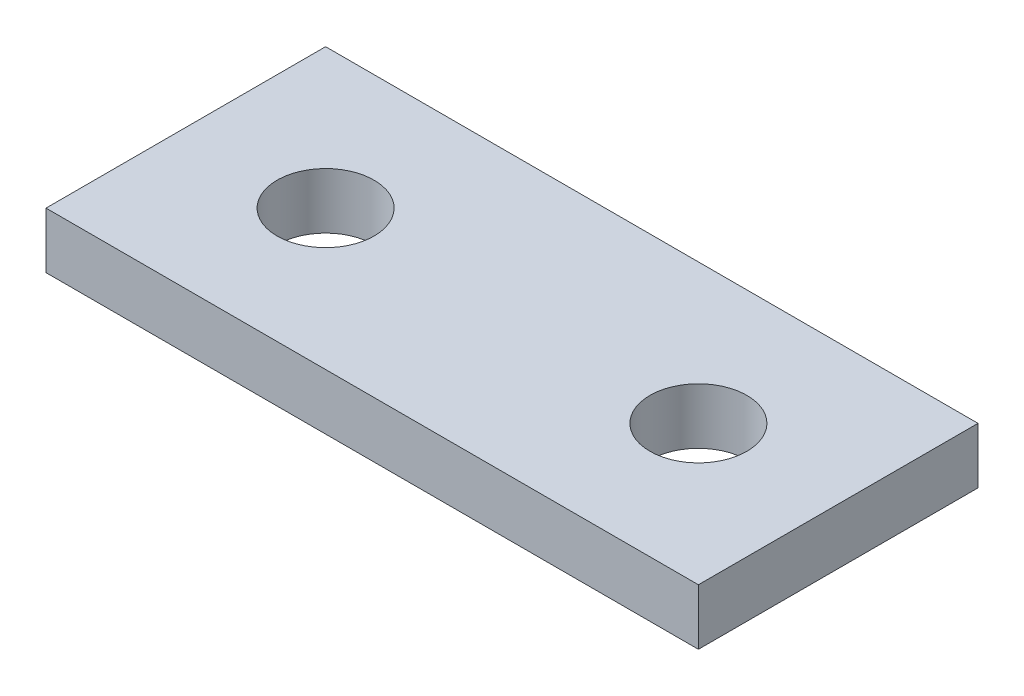
ISO-10303-21;
HEADER;
FILE_DESCRIPTION(('STEP AP214'),'2;1');
FILE_NAME('part.step','',(''),(''),'','','');
FILE_SCHEMA(('AUTOMOTIVE_DESIGN { 1 0 10303 214 1 1 1 1 }'));
ENDSEC;
DATA;
#1=APPLICATION_CONTEXT('core data for automotive mechanical design processes');
#2=APPLICATION_PROTOCOL_DEFINITION('international standard','automotive_design',2000,#1);
#3=PRODUCT_CONTEXT('',#1,'mechanical');
#4=PRODUCT('Part','Part','',(#3));
#5=PRODUCT_RELATED_PRODUCT_CATEGORY('part','',(#4));
#6=PRODUCT_DEFINITION_FORMATION('','',#4);
#7=PRODUCT_DEFINITION_CONTEXT('part definition',#1,'design');
#8=PRODUCT_DEFINITION('design','',#6,#7);
#9=PRODUCT_DEFINITION_SHAPE('','',#8);
#10=(LENGTH_UNIT() NAMED_UNIT(*) SI_UNIT(.MILLI.,.METRE.));
#11=(NAMED_UNIT(*) PLANE_ANGLE_UNIT() SI_UNIT($,.RADIAN.));
#12=(NAMED_UNIT(*) SI_UNIT($,.STERADIAN.) SOLID_ANGLE_UNIT());
#13=UNCERTAINTY_MEASURE_WITH_UNIT(LENGTH_MEASURE(1.E-05),#10,'distance_accuracy_value','');
#14=(GEOMETRIC_REPRESENTATION_CONTEXT(3) GLOBAL_UNCERTAINTY_ASSIGNED_CONTEXT((#13)) GLOBAL_UNIT_ASSIGNED_CONTEXT((#10,
#11,#12)) REPRESENTATION_CONTEXT('',''));
#15=CARTESIAN_POINT('',(0.,0.,0.));
#16=DIRECTION('',(0.,0.,1.));
#17=DIRECTION('',(1.,0.,0.));
#18=AXIS2_PLACEMENT_3D('',#15,#16,#17);
#19=CARTESIAN_POINT('',(0.,3.,0.));
#20=DIRECTION('',(0.,1.,0.));
#21=DIRECTION('',(0.,0.,1.));
#22=AXIS2_PLACEMENT_3D('',#19,#20,#21);
#23=PLANE('',#22);
#24=CARTESIAN_POINT('',(10.,3.,0.));
#25=DIRECTION('',(0.,1.,0.));
#26=DIRECTION('',(0.,0.,1.));
#27=AXIS2_PLACEMENT_3D('',#24,#25,#26);
#28=CIRCLE('',#27,2.6);
#29=CARTESIAN_POINT('',(10.,3.,2.6));
#30=VERTEX_POINT('',#29);
#31=EDGE_CURVE('E101',#30,#30,#28,.T.);
#32=ORIENTED_EDGE('',*,*,#31,.F.);
#33=EDGE_LOOP('',(#32));
#34=FACE_BOUND('',#33,.T.);
#35=DIRECTION('',(0.,0.,-1.));
#36=VECTOR('',#35,1.);
#37=CARTESIAN_POINT('',(17.5,3.,-7.5));
#38=LINE('',#37,#36);
#39=CARTESIAN_POINT('',(17.5,3.,7.5));
#40=VERTEX_POINT('',#39);
#41=CARTESIAN_POINT('',(17.5,3.,-7.5));
#42=VERTEX_POINT('',#41);
#43=EDGE_CURVE('E86',#40,#42,#38,.T.);
#44=ORIENTED_EDGE('',*,*,#43,.T.);
#45=DIRECTION('',(-1.,0.,0.));
#46=VECTOR('',#45,1.);
#47=CARTESIAN_POINT('',(-17.5,3.,-7.5));
#48=LINE('',#47,#46);
#49=CARTESIAN_POINT('',(-17.5,3.,-7.5));
#50=VERTEX_POINT('',#49);
#51=EDGE_CURVE('E81',#42,#50,#48,.T.);
#52=ORIENTED_EDGE('',*,*,#51,.T.);
#53=DIRECTION('',(0.,0.,1.));
#54=VECTOR('',#53,1.);
#55=CARTESIAN_POINT('',(-17.5,3.,-7.5));
#56=LINE('',#55,#54);
#57=CARTESIAN_POINT('',(-17.5,3.,7.5));
#58=VERTEX_POINT('',#57);
#59=EDGE_CURVE('E84',#50,#58,#56,.T.);
#60=ORIENTED_EDGE('',*,*,#59,.T.);
#61=DIRECTION('',(1.,0.,0.));
#62=VECTOR('',#61,1.);
#63=CARTESIAN_POINT('',(-17.5,3.,7.5));
#64=LINE('',#63,#62);
#65=EDGE_CURVE('E51',#58,#40,#64,.T.);
#66=ORIENTED_EDGE('',*,*,#65,.T.);
#67=EDGE_LOOP('',(#44,#52,#60,#66));
#68=FACE_BOUND('',#67,.T.);
#69=CARTESIAN_POINT('',(-10.,3.,0.));
#70=DIRECTION('',(0.,1.,0.));
#71=DIRECTION('',(0.,0.,1.));
#72=AXIS2_PLACEMENT_3D('',#69,#70,#71);
#73=CIRCLE('',#72,2.6);
#74=CARTESIAN_POINT('',(-10.,3.,2.6));
#75=VERTEX_POINT('',#74);
#76=EDGE_CURVE('E116',#75,#75,#73,.T.);
#77=ORIENTED_EDGE('',*,*,#76,.F.);
#78=EDGE_LOOP('',(#77));
#79=FACE_BOUND('',#78,.T.);
#80=ADVANCED_FACE('F34',(#34,#68,#79),#23,.T.);
#81=CARTESIAN_POINT('',(0.,0.,0.));
#82=DIRECTION('',(0.,1.,0.));
#83=DIRECTION('',(0.,0.,1.));
#84=AXIS2_PLACEMENT_3D('',#81,#82,#83);
#85=PLANE('',#84);
#86=DIRECTION('',(0.,0.,-1.));
#87=VECTOR('',#86,1.);
#88=CARTESIAN_POINT('',(17.5,0.,-7.5));
#89=LINE('',#88,#87);
#90=CARTESIAN_POINT('',(17.5,0.,7.5));
#91=VERTEX_POINT('',#90);
#92=CARTESIAN_POINT('',(17.5,0.,-7.5));
#93=VERTEX_POINT('',#92);
#94=EDGE_CURVE('E98',#91,#93,#89,.T.);
#95=ORIENTED_EDGE('',*,*,#94,.F.);
#96=DIRECTION('',(1.,0.,0.));
#97=VECTOR('',#96,1.);
#98=CARTESIAN_POINT('',(-17.5,0.,7.5));
#99=LINE('',#98,#97);
#100=CARTESIAN_POINT('',(-17.5,0.,7.5));
#101=VERTEX_POINT('',#100);
#102=EDGE_CURVE('E74',#101,#91,#99,.T.);
#103=ORIENTED_EDGE('',*,*,#102,.F.);
#104=DIRECTION('',(0.,0.,1.));
#105=VECTOR('',#104,1.);
#106=CARTESIAN_POINT('',(-17.5,0.,-7.5));
#107=LINE('',#106,#105);
#108=CARTESIAN_POINT('',(-17.5,0.,-7.5));
#109=VERTEX_POINT('',#108);
#110=EDGE_CURVE('E68',#109,#101,#107,.T.);
#111=ORIENTED_EDGE('',*,*,#110,.F.);
#112=DIRECTION('',(-1.,0.,0.));
#113=VECTOR('',#112,1.);
#114=CARTESIAN_POINT('',(-17.5,0.,-7.5));
#115=LINE('',#114,#113);
#116=EDGE_CURVE('E90',#93,#109,#115,.T.);
#117=ORIENTED_EDGE('',*,*,#116,.F.);
#118=EDGE_LOOP('',(#95,#103,#111,#117));
#119=FACE_BOUND('',#118,.T.);
#120=CARTESIAN_POINT('',(10.,0.,0.));
#121=DIRECTION('',(0.,1.,0.));
#122=DIRECTION('',(0.,0.,1.));
#123=AXIS2_PLACEMENT_3D('',#120,#121,#122);
#124=CIRCLE('',#123,2.6);
#125=CARTESIAN_POINT('',(10.,0.,2.6));
#126=VERTEX_POINT('',#125);
#127=EDGE_CURVE('E113',#126,#126,#124,.T.);
#128=ORIENTED_EDGE('',*,*,#127,.T.);
#129=EDGE_LOOP('',(#128));
#130=FACE_BOUND('',#129,.T.);
#131=CARTESIAN_POINT('',(-10.,0.,0.));
#132=DIRECTION('',(0.,1.,0.));
#133=DIRECTION('',(0.,0.,1.));
#134=AXIS2_PLACEMENT_3D('',#131,#132,#133);
#135=CIRCLE('',#134,2.6);
#136=CARTESIAN_POINT('',(-10.,0.,2.6));
#137=VERTEX_POINT('',#136);
#138=EDGE_CURVE('E119',#137,#137,#135,.T.);
#139=ORIENTED_EDGE('',*,*,#138,.T.);
#140=EDGE_LOOP('',(#139));
#141=FACE_BOUND('',#140,.T.);
#142=ADVANCED_FACE('F109',(#119,#130,#141),#85,.F.);
#143=CARTESIAN_POINT('',(17.5,3.,-7.5));
#144=DIRECTION('',(-1.,0.,0.));
#145=DIRECTION('',(0.,0.,1.));
#146=AXIS2_PLACEMENT_3D('',#143,#144,#145);
#147=PLANE('',#146);
#148=ORIENTED_EDGE('',*,*,#94,.T.);
#149=DIRECTION('',(0.,-1.,0.));
#150=VECTOR('',#149,1.);
#151=CARTESIAN_POINT('',(17.5,3.,-7.5));
#152=LINE('',#151,#150);
#153=EDGE_CURVE('E11',#42,#93,#152,.T.);
#154=ORIENTED_EDGE('',*,*,#153,.F.);
#155=ORIENTED_EDGE('',*,*,#43,.F.);
#156=DIRECTION('',(0.,-1.,0.));
#157=VECTOR('',#156,1.);
#158=CARTESIAN_POINT('',(17.5,3.,7.5));
#159=LINE('',#158,#157);
#160=EDGE_CURVE('E94',#40,#91,#159,.T.);
#161=ORIENTED_EDGE('',*,*,#160,.T.);
#162=EDGE_LOOP('',(#148,#154,#155,#161));
#163=FACE_BOUND('',#162,.T.);
#164=ADVANCED_FACE('F36',(#163),#147,.F.);
#165=CARTESIAN_POINT('',(-17.5,3.,-7.5));
#166=DIRECTION('',(0.,0.,1.));
#167=DIRECTION('',(1.,0.,0.));
#168=AXIS2_PLACEMENT_3D('',#165,#166,#167);
#169=PLANE('',#168);
#170=ORIENTED_EDGE('',*,*,#116,.T.);
#171=DIRECTION('',(0.,-1.,0.));
#172=VECTOR('',#171,1.);
#173=CARTESIAN_POINT('',(-17.5,3.,-7.5));
#174=LINE('',#173,#172);
#175=EDGE_CURVE('E43',#50,#109,#174,.T.);
#176=ORIENTED_EDGE('',*,*,#175,.F.);
#177=ORIENTED_EDGE('',*,*,#51,.F.);
#178=ORIENTED_EDGE('',*,*,#153,.T.);
#179=EDGE_LOOP('',(#170,#176,#177,#178));
#180=FACE_BOUND('',#179,.T.);
#181=ADVANCED_FACE('F89',(#180),#169,.F.);
#182=CARTESIAN_POINT('',(-17.5,3.,-7.5));
#183=DIRECTION('',(1.,0.,0.));
#184=DIRECTION('',(0.,0.,-1.));
#185=AXIS2_PLACEMENT_3D('',#182,#183,#184);
#186=PLANE('',#185);
#187=ORIENTED_EDGE('',*,*,#110,.T.);
#188=DIRECTION('',(0.,-1.,0.));
#189=VECTOR('',#188,1.);
#190=CARTESIAN_POINT('',(-17.5,3.,7.5));
#191=LINE('',#190,#189);
#192=EDGE_CURVE('E91',#58,#101,#191,.T.);
#193=ORIENTED_EDGE('',*,*,#192,.F.);
#194=ORIENTED_EDGE('',*,*,#59,.F.);
#195=ORIENTED_EDGE('',*,*,#175,.T.);
#196=EDGE_LOOP('',(#187,#193,#194,#195));
#197=FACE_BOUND('',#196,.T.);
#198=ADVANCED_FACE('F92',(#197),#186,.F.);
#199=CARTESIAN_POINT('',(-17.5,3.,7.5));
#200=DIRECTION('',(0.,0.,-1.));
#201=DIRECTION('',(-1.,0.,0.));
#202=AXIS2_PLACEMENT_3D('',#199,#200,#201);
#203=PLANE('',#202);
#204=ORIENTED_EDGE('',*,*,#102,.T.);
#205=ORIENTED_EDGE('',*,*,#160,.F.);
#206=ORIENTED_EDGE('',*,*,#65,.F.);
#207=ORIENTED_EDGE('',*,*,#192,.T.);
#208=EDGE_LOOP('',(#204,#205,#206,#207));
#209=FACE_BOUND('',#208,.T.);
#210=ADVANCED_FACE('F106',(#209),#203,.F.);
#211=CARTESIAN_POINT('',(10.,3.,0.));
#212=DIRECTION('',(0.,-1.,0.));
#213=DIRECTION('',(0.,0.,-1.));
#214=AXIS2_PLACEMENT_3D('',#211,#212,#213);
#215=CYLINDRICAL_SURFACE('',#214,2.6);
#216=ORIENTED_EDGE('',*,*,#31,.T.);
#217=EDGE_LOOP('',(#216));
#218=FACE_BOUND('',#217,.T.);
#219=ORIENTED_EDGE('',*,*,#127,.F.);
#220=EDGE_LOOP('',(#219));
#221=FACE_BOUND('',#220,.T.);
#222=ADVANCED_FACE('F136',(#218,#221),#215,.F.);
#223=CARTESIAN_POINT('',(-10.,3.,0.));
#224=DIRECTION('',(0.,-1.,0.));
#225=DIRECTION('',(0.,0.,-1.));
#226=AXIS2_PLACEMENT_3D('',#223,#224,#225);
#227=CYLINDRICAL_SURFACE('',#226,2.6);
#228=ORIENTED_EDGE('',*,*,#76,.T.);
#229=EDGE_LOOP('',(#228));
#230=FACE_BOUND('',#229,.T.);
#231=ORIENTED_EDGE('',*,*,#138,.F.);
#232=EDGE_LOOP('',(#231));
#233=FACE_BOUND('',#232,.T.);
#234=ADVANCED_FACE('F125',(#230,#233),#227,.F.);
#235=CLOSED_SHELL('',(#80,#142,#164,#181,#198,#210,#222,#234));
#236=MANIFOLD_SOLID_BREP('B2',#235);
#237=ADVANCED_BREP_SHAPE_REPRESENTATION('',(#18,#236),#14);
#238=SHAPE_DEFINITION_REPRESENTATION(#9,#237);
ENDSEC;
END-ISO-10303-21;
